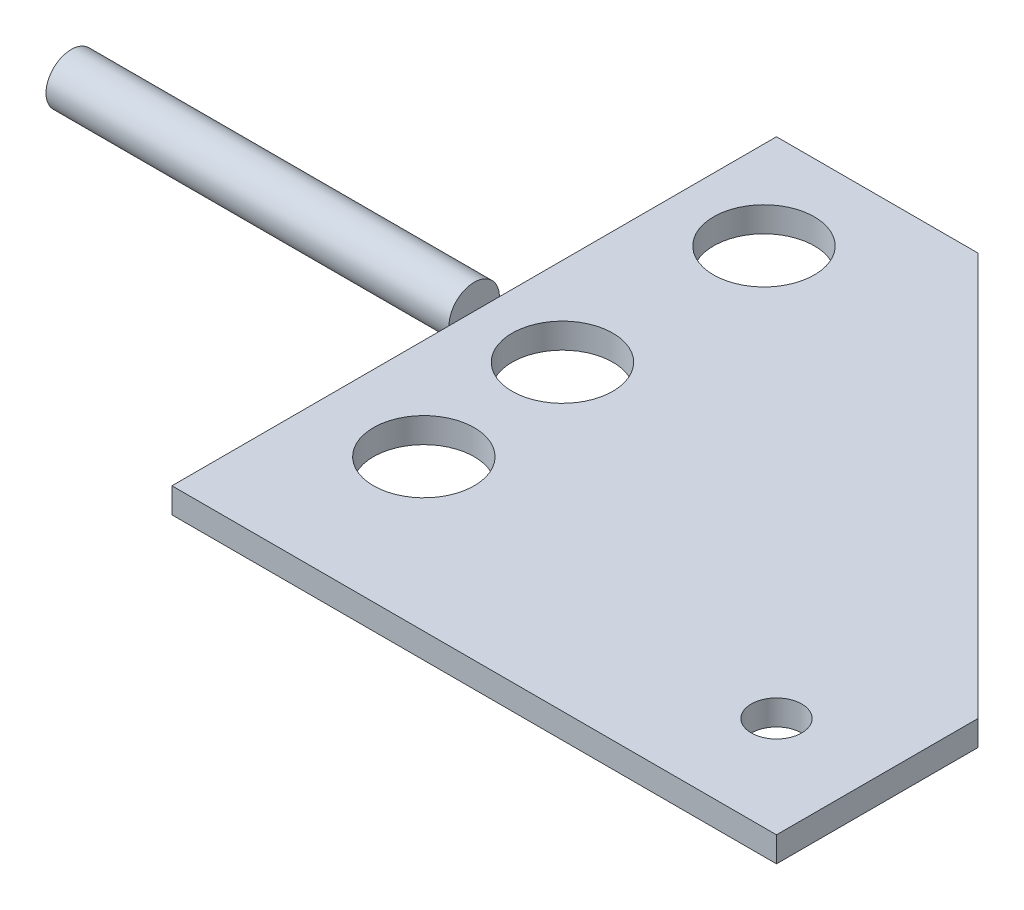
ISO-10303-21;
HEADER;
FILE_DESCRIPTION(('STEP AP214'),'2;1');
FILE_NAME('part.step','',(''),(''),'','','');
FILE_SCHEMA(('AUTOMOTIVE_DESIGN { 1 0 10303 214 1 1 1 1 }'));
ENDSEC;
DATA;
#1=APPLICATION_CONTEXT('core data for automotive mechanical design processes');
#2=APPLICATION_PROTOCOL_DEFINITION('international standard','automotive_design',2000,#1);
#3=PRODUCT_CONTEXT('',#1,'mechanical');
#4=PRODUCT('Part','Part','',(#3));
#5=PRODUCT_RELATED_PRODUCT_CATEGORY('part','',(#4));
#6=PRODUCT_DEFINITION_FORMATION('','',#4);
#7=PRODUCT_DEFINITION_CONTEXT('part definition',#1,'design');
#8=PRODUCT_DEFINITION('design','',#6,#7);
#9=PRODUCT_DEFINITION_SHAPE('','',#8);
#10=(LENGTH_UNIT() NAMED_UNIT(*) SI_UNIT(.MILLI.,.METRE.));
#11=(NAMED_UNIT(*) PLANE_ANGLE_UNIT() SI_UNIT($,.RADIAN.));
#12=(NAMED_UNIT(*) SI_UNIT($,.STERADIAN.) SOLID_ANGLE_UNIT());
#13=UNCERTAINTY_MEASURE_WITH_UNIT(LENGTH_MEASURE(1.E-05),#10,'distance_accuracy_value','');
#14=(GEOMETRIC_REPRESENTATION_CONTEXT(3) GLOBAL_UNCERTAINTY_ASSIGNED_CONTEXT((#13)) GLOBAL_UNIT_ASSIGNED_CONTEXT((#10,
#11,#12)) REPRESENTATION_CONTEXT('',''));
#15=CARTESIAN_POINT('',(0.,0.,0.));
#16=DIRECTION('',(0.,0.,1.));
#17=DIRECTION('',(1.,0.,0.));
#18=AXIS2_PLACEMENT_3D('',#15,#16,#17);
#19=CARTESIAN_POINT('',(-76.2,6.35,-76.2));
#20=DIRECTION('',(1.,0.,0.));
#21=DIRECTION('',(0.,0.,-1.));
#22=AXIS2_PLACEMENT_3D('',#19,#20,#21);
#23=PLANE('',#22);
#24=CARTESIAN_POINT('',(-76.2,6.35,0.));
#25=DIRECTION('',(-1.,0.,0.));
#26=DIRECTION('',(0.,0.,1.));
#27=AXIS2_PLACEMENT_3D('',#24,#25,#26);
#28=CIRCLE('',#27,6.35);
#29=CARTESIAN_POINT('',(-76.2,6.35,-6.34999999999999));
#30=VERTEX_POINT('',#29);
#31=CARTESIAN_POINT('',(-76.2,0.,0.));
#32=VERTEX_POINT('',#31);
#33=EDGE_CURVE('E11',#30,#32,#28,.T.);
#34=ORIENTED_EDGE('',*,*,#33,.F.);
#35=DIRECTION('',(0.,0.,1.));
#36=VECTOR('',#35,1.);
#37=CARTESIAN_POINT('',(-76.2,6.35,-76.2));
#38=LINE('',#37,#36);
#39=CARTESIAN_POINT('',(-76.2,6.35,-76.2));
#40=VERTEX_POINT('',#39);
#41=EDGE_CURVE('E95',#40,#30,#38,.T.);
#42=ORIENTED_EDGE('',*,*,#41,.F.);
#43=DIRECTION('',(0.,-1.,0.));
#44=VECTOR('',#43,1.);
#45=CARTESIAN_POINT('',(-76.2,6.35,-76.2));
#46=LINE('',#45,#44);
#47=CARTESIAN_POINT('',(-76.2,0.,-76.2));
#48=VERTEX_POINT('',#47);
#49=EDGE_CURVE('E107',#40,#48,#46,.T.);
#50=ORIENTED_EDGE('',*,*,#49,.T.);
#51=DIRECTION('',(0.,0.,1.));
#52=VECTOR('',#51,1.);
#53=CARTESIAN_POINT('',(-76.2,0.,-76.2));
#54=LINE('',#53,#52);
#55=EDGE_CURVE('E129',#48,#32,#54,.T.);
#56=ORIENTED_EDGE('',*,*,#55,.T.);
#57=EDGE_LOOP('',(#34,#42,#50,#56));
#58=FACE_BOUND('',#57,.T.);
#59=ADVANCED_FACE('F33',(#58),#23,.F.);
#60=CARTESIAN_POINT('',(-25.4,6.35,-76.2));
#61=DIRECTION('',(0.,0.,1.));
#62=DIRECTION('',(1.,0.,0.));
#63=AXIS2_PLACEMENT_3D('',#60,#61,#62);
#64=PLANE('',#63);
#65=DIRECTION('',(-1.,0.,0.));
#66=VECTOR('',#65,1.);
#67=CARTESIAN_POINT('',(-25.4,0.,-76.2));
#68=LINE('',#67,#66);
#69=CARTESIAN_POINT('',(-25.4,0.,-76.2));
#70=VERTEX_POINT('',#69);
#71=EDGE_CURVE('E111',#70,#48,#68,.T.);
#72=ORIENTED_EDGE('',*,*,#71,.T.);
#73=ORIENTED_EDGE('',*,*,#49,.F.);
#74=DIRECTION('',(-1.,0.,0.));
#75=VECTOR('',#74,1.);
#76=CARTESIAN_POINT('',(-25.4,6.35,-76.2));
#77=LINE('',#76,#75);
#78=CARTESIAN_POINT('',(-25.4,6.35,-76.2));
#79=VERTEX_POINT('',#78);
#80=EDGE_CURVE('E104',#79,#40,#77,.T.);
#81=ORIENTED_EDGE('',*,*,#80,.F.);
#82=DIRECTION('',(0.,-1.,0.));
#83=VECTOR('',#82,1.);
#84=CARTESIAN_POINT('',(-25.4,6.35,-76.2));
#85=LINE('',#84,#83);
#86=EDGE_CURVE('E125',#79,#70,#85,.T.);
#87=ORIENTED_EDGE('',*,*,#86,.T.);
#88=EDGE_LOOP('',(#72,#73,#81,#87));
#89=FACE_BOUND('',#88,.T.);
#90=ADVANCED_FACE('F35',(#89),#64,.F.);
#91=CARTESIAN_POINT('',(-76.2,6.35,6.35000000000001));
#92=VERTEX_POINT('',#91);
#93=EDGE_CURVE('E42',#32,#92,#28,.T.);
#94=ORIENTED_EDGE('',*,*,#93,.F.);
#95=CARTESIAN_POINT('',(-76.2,0.,76.2));
#96=VERTEX_POINT('',#95);
#97=EDGE_CURVE('E128',#32,#96,#54,.T.);
#98=ORIENTED_EDGE('',*,*,#97,.T.);
#99=DIRECTION('',(0.,-1.,0.));
#100=VECTOR('',#99,1.);
#101=CARTESIAN_POINT('',(-76.2,6.35,76.2));
#102=LINE('',#101,#100);
#103=CARTESIAN_POINT('',(-76.2,6.35,76.2));
#104=VERTEX_POINT('',#103);
#105=EDGE_CURVE('E102',#104,#96,#102,.T.);
#106=ORIENTED_EDGE('',*,*,#105,.F.);
#107=EDGE_CURVE('E93',#92,#104,#38,.T.);
#108=ORIENTED_EDGE('',*,*,#107,.F.);
#109=EDGE_LOOP('',(#94,#98,#106,#108));
#110=FACE_BOUND('',#109,.T.);
#111=ADVANCED_FACE('F100',(#110),#23,.F.);
#112=CARTESIAN_POINT('',(-76.2,6.35,76.2));
#113=DIRECTION('',(0.,0.,-1.));
#114=DIRECTION('',(-1.,0.,0.));
#115=AXIS2_PLACEMENT_3D('',#112,#113,#114);
#116=PLANE('',#115);
#117=DIRECTION('',(1.,0.,0.));
#118=VECTOR('',#117,1.);
#119=CARTESIAN_POINT('',(-76.2,0.,76.2));
#120=LINE('',#119,#118);
#121=CARTESIAN_POINT('',(76.2,0.,76.2));
#122=VERTEX_POINT('',#121);
#123=EDGE_CURVE('E131',#96,#122,#120,.T.);
#124=ORIENTED_EDGE('',*,*,#123,.T.);
#125=DIRECTION('',(0.,-1.,0.));
#126=VECTOR('',#125,1.);
#127=CARTESIAN_POINT('',(76.2,6.35,76.2));
#128=LINE('',#127,#126);
#129=CARTESIAN_POINT('',(76.2,6.35,76.2));
#130=VERTEX_POINT('',#129);
#131=EDGE_CURVE('E141',#130,#122,#128,.T.);
#132=ORIENTED_EDGE('',*,*,#131,.F.);
#133=DIRECTION('',(1.,0.,0.));
#134=VECTOR('',#133,1.);
#135=CARTESIAN_POINT('',(-76.2,6.35,76.2));
#136=LINE('',#135,#134);
#137=EDGE_CURVE('E119',#104,#130,#136,.T.);
#138=ORIENTED_EDGE('',*,*,#137,.F.);
#139=ORIENTED_EDGE('',*,*,#105,.T.);
#140=EDGE_LOOP('',(#124,#132,#138,#139));
#141=FACE_BOUND('',#140,.T.);
#142=ADVANCED_FACE('F191',(#141),#116,.F.);
#143=CARTESIAN_POINT('',(76.2,6.35,76.2));
#144=DIRECTION('',(-1.,0.,0.));
#145=DIRECTION('',(0.,0.,1.));
#146=AXIS2_PLACEMENT_3D('',#143,#144,#145);
#147=PLANE('',#146);
#148=DIRECTION('',(0.,0.,-1.));
#149=VECTOR('',#148,1.);
#150=CARTESIAN_POINT('',(76.2,0.,76.2));
#151=LINE('',#150,#149);
#152=CARTESIAN_POINT('',(76.2,0.,25.4));
#153=VERTEX_POINT('',#152);
#154=EDGE_CURVE('E133',#122,#153,#151,.T.);
#155=ORIENTED_EDGE('',*,*,#154,.T.);
#156=DIRECTION('',(0.,-1.,0.));
#157=VECTOR('',#156,1.);
#158=CARTESIAN_POINT('',(76.2,6.35,25.4));
#159=LINE('',#158,#157);
#160=CARTESIAN_POINT('',(76.2,6.35,25.4));
#161=VERTEX_POINT('',#160);
#162=EDGE_CURVE('E138',#161,#153,#159,.T.);
#163=ORIENTED_EDGE('',*,*,#162,.F.);
#164=DIRECTION('',(0.,0.,-1.));
#165=VECTOR('',#164,1.);
#166=CARTESIAN_POINT('',(76.2,6.35,76.2));
#167=LINE('',#166,#165);
#168=EDGE_CURVE('E121',#130,#161,#167,.T.);
#169=ORIENTED_EDGE('',*,*,#168,.F.);
#170=ORIENTED_EDGE('',*,*,#131,.T.);
#171=EDGE_LOOP('',(#155,#163,#169,#170));
#172=FACE_BOUND('',#171,.T.);
#173=ADVANCED_FACE('F195',(#172),#147,.F.);
#174=CARTESIAN_POINT('',(76.2,6.35,25.4));
#175=DIRECTION('',(-0.707106781186547,0.,0.707106781186548));
#176=DIRECTION('',(0.707106781186548,0.,0.707106781186547));
#177=AXIS2_PLACEMENT_3D('',#174,#175,#176);
#178=PLANE('',#177);
#179=DIRECTION('',(-0.707106781186548,0.,-0.707106781186547));
#180=VECTOR('',#179,1.);
#181=CARTESIAN_POINT('',(76.2,0.,25.4));
#182=LINE('',#181,#180);
#183=EDGE_CURVE('E117',#153,#70,#182,.T.);
#184=ORIENTED_EDGE('',*,*,#183,.T.);
#185=ORIENTED_EDGE('',*,*,#86,.F.);
#186=DIRECTION('',(-0.707106781186548,0.,-0.707106781186547));
#187=VECTOR('',#186,1.);
#188=CARTESIAN_POINT('',(76.2,6.35,25.4));
#189=LINE('',#188,#187);
#190=EDGE_CURVE('E123',#161,#79,#189,.T.);
#191=ORIENTED_EDGE('',*,*,#190,.F.);
#192=ORIENTED_EDGE('',*,*,#162,.T.);
#193=EDGE_LOOP('',(#184,#185,#191,#192));
#194=FACE_BOUND('',#193,.T.);
#195=ADVANCED_FACE('F200',(#194),#178,.F.);
#196=CARTESIAN_POINT('',(0.,6.35,0.));
#197=DIRECTION('',(0.,1.,0.));
#198=DIRECTION('',(0.,0.,1.));
#199=AXIS2_PLACEMENT_3D('',#196,#197,#198);
#200=PLANE('',#199);
#201=CARTESIAN_POINT('',(-53.9562097821009,6.35,-50.8));
#202=DIRECTION('',(0.,1.,0.));
#203=DIRECTION('',(0.,0.,1.));
#204=AXIS2_PLACEMENT_3D('',#201,#202,#203);
#205=CIRCLE('',#204,12.7);
#206=CARTESIAN_POINT('',(-53.9562097821009,6.35,-38.1));
#207=VERTEX_POINT('',#206);
#208=EDGE_CURVE('E161',#207,#207,#205,.T.);
#209=ORIENTED_EDGE('',*,*,#208,.F.);
#210=EDGE_LOOP('',(#209));
#211=FACE_BOUND('',#210,.T.);
#212=CARTESIAN_POINT('',(-53.9562097821009,6.35,0.));
#213=DIRECTION('',(0.,1.,0.));
#214=DIRECTION('',(0.,0.,1.));
#215=AXIS2_PLACEMENT_3D('',#212,#213,#214);
#216=CIRCLE('',#215,12.7);
#217=CARTESIAN_POINT('',(-53.9562097821009,6.35,12.7));
#218=VERTEX_POINT('',#217);
#219=EDGE_CURVE('E158',#218,#218,#216,.T.);
#220=ORIENTED_EDGE('',*,*,#219,.F.);
#221=EDGE_LOOP('',(#220));
#222=FACE_BOUND('',#221,.T.);
#223=CARTESIAN_POINT('',(-50.8,6.35,38.1));
#224=DIRECTION('',(0.,1.,0.));
#225=DIRECTION('',(0.,0.,1.));
#226=AXIS2_PLACEMENT_3D('',#223,#224,#225);
#227=CIRCLE('',#226,12.7);
#228=CARTESIAN_POINT('',(-50.8,6.35,50.8));
#229=VERTEX_POINT('',#228);
#230=EDGE_CURVE('E147',#229,#229,#227,.T.);
#231=ORIENTED_EDGE('',*,*,#230,.F.);
#232=EDGE_LOOP('',(#231));
#233=FACE_BOUND('',#232,.T.);
#234=CARTESIAN_POINT('',(50.8,6.35,50.8));
#235=DIRECTION('',(0.,1.,0.));
#236=DIRECTION('',(0.,0.,1.));
#237=AXIS2_PLACEMENT_3D('',#234,#235,#236);
#238=CIRCLE('',#237,6.35);
#239=CARTESIAN_POINT('',(50.8,6.35,57.15));
#240=VERTEX_POINT('',#239);
#241=EDGE_CURVE('E151',#240,#240,#238,.T.);
#242=ORIENTED_EDGE('',*,*,#241,.F.);
#243=EDGE_LOOP('',(#242));
#244=FACE_BOUND('',#243,.T.);
#245=ORIENTED_EDGE('',*,*,#80,.T.);
#246=ORIENTED_EDGE('',*,*,#41,.T.);
#247=EDGE_CURVE('E90',#30,#92,#38,.T.);
#248=ORIENTED_EDGE('',*,*,#247,.T.);
#249=ORIENTED_EDGE('',*,*,#107,.T.);
#250=ORIENTED_EDGE('',*,*,#137,.T.);
#251=ORIENTED_EDGE('',*,*,#168,.T.);
#252=ORIENTED_EDGE('',*,*,#190,.T.);
#253=EDGE_LOOP('',(#245,#246,#248,#249,#250,#251,#252));
#254=FACE_BOUND('',#253,.T.);
#255=ADVANCED_FACE('F92',(#211,#222,#233,#244,#254),#200,.T.);
#256=CARTESIAN_POINT('',(0.,0.,0.));
#257=DIRECTION('',(0.,1.,0.));
#258=DIRECTION('',(0.,0.,1.));
#259=AXIS2_PLACEMENT_3D('',#256,#257,#258);
#260=PLANE('',#259);
#261=CARTESIAN_POINT('',(-53.9562097821009,0.,-50.8));
#262=DIRECTION('',(0.,1.,0.));
#263=DIRECTION('',(0.,0.,1.));
#264=AXIS2_PLACEMENT_3D('',#261,#262,#263);
#265=CIRCLE('',#264,12.7);
#266=CARTESIAN_POINT('',(-53.9562097821009,0.,-38.1));
#267=VERTEX_POINT('',#266);
#268=EDGE_CURVE('E166',#267,#267,#265,.T.);
#269=ORIENTED_EDGE('',*,*,#268,.T.);
#270=EDGE_LOOP('',(#269));
#271=FACE_BOUND('',#270,.T.);
#272=CARTESIAN_POINT('',(-53.9562097821009,0.,0.));
#273=DIRECTION('',(0.,1.,0.));
#274=DIRECTION('',(0.,0.,1.));
#275=AXIS2_PLACEMENT_3D('',#272,#273,#274);
#276=CIRCLE('',#275,12.7);
#277=CARTESIAN_POINT('',(-53.9562097821009,0.,12.7));
#278=VERTEX_POINT('',#277);
#279=EDGE_CURVE('E156',#278,#278,#276,.T.);
#280=ORIENTED_EDGE('',*,*,#279,.T.);
#281=EDGE_LOOP('',(#280));
#282=FACE_BOUND('',#281,.T.);
#283=CARTESIAN_POINT('',(-50.8,0.,38.1));
#284=DIRECTION('',(0.,1.,0.));
#285=DIRECTION('',(0.,0.,1.));
#286=AXIS2_PLACEMENT_3D('',#283,#284,#285);
#287=CIRCLE('',#286,12.7);
#288=CARTESIAN_POINT('',(-50.8,0.,50.8));
#289=VERTEX_POINT('',#288);
#290=EDGE_CURVE('E37',#289,#289,#287,.T.);
#291=ORIENTED_EDGE('',*,*,#290,.T.);
#292=EDGE_LOOP('',(#291));
#293=FACE_BOUND('',#292,.T.);
#294=CARTESIAN_POINT('',(50.8,0.,50.8));
#295=DIRECTION('',(0.,1.,0.));
#296=DIRECTION('',(0.,0.,1.));
#297=AXIS2_PLACEMENT_3D('',#294,#295,#296);
#298=CIRCLE('',#297,6.35);
#299=CARTESIAN_POINT('',(50.8,0.,57.15));
#300=VERTEX_POINT('',#299);
#301=EDGE_CURVE('E114',#300,#300,#298,.T.);
#302=ORIENTED_EDGE('',*,*,#301,.T.);
#303=EDGE_LOOP('',(#302));
#304=FACE_BOUND('',#303,.T.);
#305=ORIENTED_EDGE('',*,*,#71,.F.);
#306=ORIENTED_EDGE('',*,*,#183,.F.);
#307=ORIENTED_EDGE('',*,*,#154,.F.);
#308=ORIENTED_EDGE('',*,*,#123,.F.);
#309=ORIENTED_EDGE('',*,*,#97,.F.);
#310=ORIENTED_EDGE('',*,*,#55,.F.);
#311=EDGE_LOOP('',(#305,#306,#307,#308,#309,#310));
#312=FACE_BOUND('',#311,.T.);
#313=ADVANCED_FACE('F170',(#271,#282,#293,#304,#312),#260,.F.);
#314=CARTESIAN_POINT('',(-177.8,6.35,0.));
#315=DIRECTION('',(1.,0.,0.));
#316=DIRECTION('',(0.,0.,-1.));
#317=AXIS2_PLACEMENT_3D('',#314,#315,#316);
#318=CYLINDRICAL_SURFACE('',#317,6.35);
#319=CARTESIAN_POINT('',(-177.8,6.35,0.));
#320=DIRECTION('',(-1.,0.,0.));
#321=DIRECTION('',(0.,0.,1.));
#322=AXIS2_PLACEMENT_3D('',#319,#320,#321);
#323=CIRCLE('',#322,6.35);
#324=CARTESIAN_POINT('',(-177.8,6.35,6.35000000000001));
#325=VERTEX_POINT('',#324);
#326=EDGE_CURVE('E109',#325,#325,#323,.T.);
#327=ORIENTED_EDGE('',*,*,#326,.F.);
#328=EDGE_LOOP('',(#327));
#329=FACE_BOUND('',#328,.T.);
#330=EDGE_CURVE('E44',#92,#30,#28,.T.);
#331=ORIENTED_EDGE('',*,*,#330,.T.);
#332=ORIENTED_EDGE('',*,*,#33,.T.);
#333=ORIENTED_EDGE('',*,*,#93,.T.);
#334=EDGE_LOOP('',(#331,#332,#333));
#335=FACE_BOUND('',#334,.T.);
#336=ADVANCED_FACE('F106',(#329,#335),#318,.T.);
#337=CARTESIAN_POINT('',(-177.8,6.35,0.));
#338=DIRECTION('',(-1.,0.,0.));
#339=DIRECTION('',(0.,0.,1.));
#340=AXIS2_PLACEMENT_3D('',#337,#338,#339);
#341=PLANE('',#340);
#342=ORIENTED_EDGE('',*,*,#326,.T.);
#343=EDGE_LOOP('',(#342));
#344=FACE_BOUND('',#343,.T.);
#345=ADVANCED_FACE('F214',(#344),#341,.T.);
#346=CARTESIAN_POINT('',(-76.2,6.35,0.));
#347=DIRECTION('',(-1.,0.,0.));
#348=DIRECTION('',(0.,0.,1.));
#349=AXIS2_PLACEMENT_3D('',#346,#347,#348);
#350=PLANE('',#349);
#351=ORIENTED_EDGE('',*,*,#247,.F.);
#352=ORIENTED_EDGE('',*,*,#330,.F.);
#353=EDGE_LOOP('',(#351,#352));
#354=FACE_BOUND('',#353,.T.);
#355=ADVANCED_FACE('F108',(#354),#350,.F.);
#356=CARTESIAN_POINT('',(50.8,-95.25,50.8));
#357=DIRECTION('',(0.,1.,0.));
#358=DIRECTION('',(0.,0.,1.));
#359=AXIS2_PLACEMENT_3D('',#356,#357,#358);
#360=CYLINDRICAL_SURFACE('',#359,6.35);
#361=ORIENTED_EDGE('',*,*,#241,.T.);
#362=EDGE_LOOP('',(#361));
#363=FACE_BOUND('',#362,.T.);
#364=ORIENTED_EDGE('',*,*,#301,.F.);
#365=EDGE_LOOP('',(#364));
#366=FACE_BOUND('',#365,.T.);
#367=ADVANCED_FACE('F218',(#363,#366),#360,.F.);
#368=CARTESIAN_POINT('',(-50.8,-95.25,38.1));
#369=DIRECTION('',(0.,1.,0.));
#370=DIRECTION('',(0.,0.,1.));
#371=AXIS2_PLACEMENT_3D('',#368,#369,#370);
#372=CYLINDRICAL_SURFACE('',#371,12.7);
#373=ORIENTED_EDGE('',*,*,#230,.T.);
#374=EDGE_LOOP('',(#373));
#375=FACE_BOUND('',#374,.T.);
#376=ORIENTED_EDGE('',*,*,#290,.F.);
#377=EDGE_LOOP('',(#376));
#378=FACE_BOUND('',#377,.T.);
#379=ADVANCED_FACE('F181',(#375,#378),#372,.F.);
#380=CARTESIAN_POINT('',(-53.9562097821009,0.,0.));
#381=DIRECTION('',(0.,1.,0.));
#382=DIRECTION('',(0.,0.,1.));
#383=AXIS2_PLACEMENT_3D('',#380,#381,#382);
#384=CYLINDRICAL_SURFACE('',#383,12.7);
#385=ORIENTED_EDGE('',*,*,#279,.F.);
#386=EDGE_LOOP('',(#385));
#387=FACE_BOUND('',#386,.T.);
#388=ORIENTED_EDGE('',*,*,#219,.T.);
#389=EDGE_LOOP('',(#388));
#390=FACE_BOUND('',#389,.T.);
#391=ADVANCED_FACE('F175',(#387,#390),#384,.F.);
#392=CARTESIAN_POINT('',(-53.9562097821009,0.,-50.8));
#393=DIRECTION('',(0.,1.,0.));
#394=DIRECTION('',(0.,0.,1.));
#395=AXIS2_PLACEMENT_3D('',#392,#393,#394);
#396=CYLINDRICAL_SURFACE('',#395,12.7);
#397=ORIENTED_EDGE('',*,*,#208,.T.);
#398=EDGE_LOOP('',(#397));
#399=FACE_BOUND('',#398,.T.);
#400=ORIENTED_EDGE('',*,*,#268,.F.);
#401=EDGE_LOOP('',(#400));
#402=FACE_BOUND('',#401,.T.);
#403=ADVANCED_FACE('F173',(#399,#402),#396,.F.);
#404=CLOSED_SHELL('',(#59,#90,#111,#142,#173,#195,#255,#313,#336,#345,#355,#367,#379,#391,#403));
#405=MANIFOLD_SOLID_BREP('B2',#404);
#406=ADVANCED_BREP_SHAPE_REPRESENTATION('',(#18,#405),#14);
#407=SHAPE_DEFINITION_REPRESENTATION(#9,#406);
ENDSEC;
END-ISO-10303-21;
